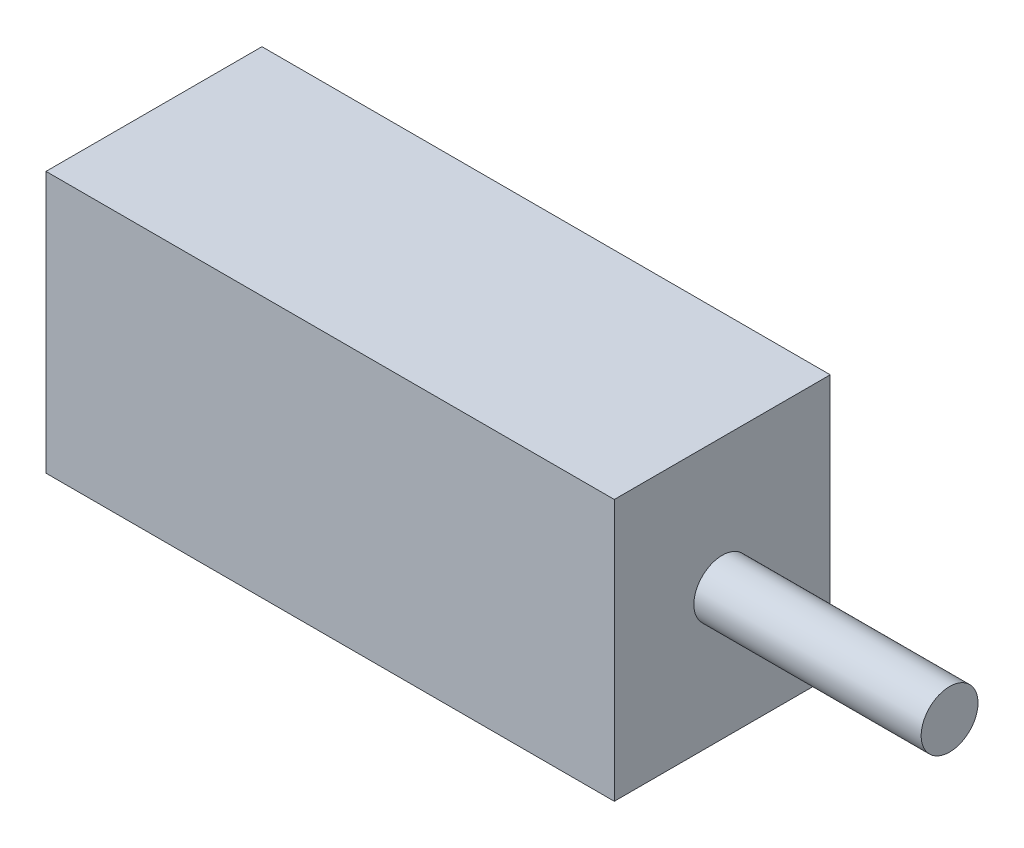
ISO-10303-21;
HEADER;
FILE_DESCRIPTION(('STEP AP214'),'2;1');
FILE_NAME('part.step','',(''),(''),'','','');
FILE_SCHEMA(('AUTOMOTIVE_DESIGN { 1 0 10303 214 1 1 1 1 }'));
ENDSEC;
DATA;
#1=APPLICATION_CONTEXT('core data for automotive mechanical design processes');
#2=APPLICATION_PROTOCOL_DEFINITION('international standard','automotive_design',2000,#1);
#3=PRODUCT_CONTEXT('',#1,'mechanical');
#4=PRODUCT('Part','Part','',(#3));
#5=PRODUCT_RELATED_PRODUCT_CATEGORY('part','',(#4));
#6=PRODUCT_DEFINITION_FORMATION('','',#4);
#7=PRODUCT_DEFINITION_CONTEXT('part definition',#1,'design');
#8=PRODUCT_DEFINITION('design','',#6,#7);
#9=PRODUCT_DEFINITION_SHAPE('','',#8);
#10=(LENGTH_UNIT() NAMED_UNIT(*) SI_UNIT(.MILLI.,.METRE.));
#11=(NAMED_UNIT(*) PLANE_ANGLE_UNIT() SI_UNIT($,.RADIAN.));
#12=(NAMED_UNIT(*) SI_UNIT($,.STERADIAN.) SOLID_ANGLE_UNIT());
#13=UNCERTAINTY_MEASURE_WITH_UNIT(LENGTH_MEASURE(1.E-05),#10,'distance_accuracy_value','');
#14=(GEOMETRIC_REPRESENTATION_CONTEXT(3) GLOBAL_UNCERTAINTY_ASSIGNED_CONTEXT((#13)) GLOBAL_UNIT_ASSIGNED_CONTEXT((#10,
#11,#12)) REPRESENTATION_CONTEXT('',''));
#15=CARTESIAN_POINT('',(0.,0.,0.));
#16=DIRECTION('',(0.,0.,1.));
#17=DIRECTION('',(1.,0.,0.));
#18=AXIS2_PLACEMENT_3D('',#15,#16,#17);
#19=CARTESIAN_POINT('',(10.,0.,0.));
#20=DIRECTION('',(-1.,0.,0.));
#21=DIRECTION('',(0.,0.,1.));
#22=AXIS2_PLACEMENT_3D('',#19,#20,#21);
#23=CYLINDRICAL_SURFACE('',#22,1.25);
#24=CARTESIAN_POINT('',(10.,0.,0.));
#25=DIRECTION('',(1.,0.,0.));
#26=DIRECTION('',(0.,0.,-1.));
#27=AXIS2_PLACEMENT_3D('',#24,#25,#26);
#28=CIRCLE('',#27,1.25);
#29=CARTESIAN_POINT('',(10.,0.,-1.25));
#30=VERTEX_POINT('',#29);
#31=EDGE_CURVE('E11',#30,#30,#28,.T.);
#32=ORIENTED_EDGE('',*,*,#31,.F.);
#33=EDGE_LOOP('',(#32));
#34=FACE_BOUND('',#33,.T.);
#35=CARTESIAN_POINT('',(0.,0.,0.));
#36=DIRECTION('',(1.,0.,0.));
#37=DIRECTION('',(0.,0.,-1.));
#38=AXIS2_PLACEMENT_3D('',#35,#36,#37);
#39=CIRCLE('',#38,1.25);
#40=CARTESIAN_POINT('',(0.,0.,-1.25));
#41=VERTEX_POINT('',#40);
#42=EDGE_CURVE('E42',#41,#41,#39,.T.);
#43=ORIENTED_EDGE('',*,*,#42,.T.);
#44=EDGE_LOOP('',(#43));
#45=FACE_BOUND('',#44,.T.);
#46=ADVANCED_FACE('F39',(#34,#45),#23,.T.);
#47=CARTESIAN_POINT('',(10.,0.,0.));
#48=DIRECTION('',(1.,0.,0.));
#49=DIRECTION('',(0.,0.,-1.));
#50=AXIS2_PLACEMENT_3D('',#47,#48,#49);
#51=PLANE('',#50);
#52=ORIENTED_EDGE('',*,*,#31,.T.);
#53=EDGE_LOOP('',(#52));
#54=FACE_BOUND('',#53,.T.);
#55=ADVANCED_FACE('F148',(#54),#51,.T.);
#56=CARTESIAN_POINT('',(-25.,5.75,4.75));
#57=DIRECTION('',(0.,0.,-1.));
#58=DIRECTION('',(0.,1.,0.));
#59=AXIS2_PLACEMENT_3D('',#56,#57,#58);
#60=PLANE('',#59);
#61=DIRECTION('',(0.,1.,0.));
#62=VECTOR('',#61,1.);
#63=CARTESIAN_POINT('',(0.,5.75,4.75));
#64=LINE('',#63,#62);
#65=CARTESIAN_POINT('',(0.,-5.75,4.75));
#66=VERTEX_POINT('',#65);
#67=CARTESIAN_POINT('',(0.,5.75,4.75));
#68=VERTEX_POINT('',#67);
#69=EDGE_CURVE('E111',#66,#68,#64,.T.);
#70=ORIENTED_EDGE('',*,*,#69,.T.);
#71=DIRECTION('',(1.,0.,0.));
#72=VECTOR('',#71,1.);
#73=CARTESIAN_POINT('',(-25.,5.75,4.75));
#74=LINE('',#73,#72);
#75=CARTESIAN_POINT('',(-25.,5.75,4.75));
#76=VERTEX_POINT('',#75);
#77=EDGE_CURVE('E100',#76,#68,#74,.T.);
#78=ORIENTED_EDGE('',*,*,#77,.F.);
#79=DIRECTION('',(0.,1.,0.));
#80=VECTOR('',#79,1.);
#81=CARTESIAN_POINT('',(-25.,5.75,4.75));
#82=LINE('',#81,#80);
#83=CARTESIAN_POINT('',(-25.,-5.75,4.75));
#84=VERTEX_POINT('',#83);
#85=EDGE_CURVE('E92',#84,#76,#82,.T.);
#86=ORIENTED_EDGE('',*,*,#85,.F.);
#87=DIRECTION('',(1.,0.,0.));
#88=VECTOR('',#87,1.);
#89=CARTESIAN_POINT('',(-25.,-5.75,4.75));
#90=LINE('',#89,#88);
#91=EDGE_CURVE('E107',#84,#66,#90,.T.);
#92=ORIENTED_EDGE('',*,*,#91,.T.);
#93=EDGE_LOOP('',(#70,#78,#86,#92));
#94=FACE_BOUND('',#93,.T.);
#95=ADVANCED_FACE('F137',(#94),#60,.F.);
#96=CARTESIAN_POINT('',(-25.,5.75,-4.75));
#97=DIRECTION('',(0.,-1.,0.));
#98=DIRECTION('',(0.,0.,-1.));
#99=AXIS2_PLACEMENT_3D('',#96,#97,#98);
#100=PLANE('',#99);
#101=DIRECTION('',(0.,0.,-1.));
#102=VECTOR('',#101,1.);
#103=CARTESIAN_POINT('',(0.,5.75,-4.75));
#104=LINE('',#103,#102);
#105=CARTESIAN_POINT('',(0.,5.75,-4.75));
#106=VERTEX_POINT('',#105);
#107=EDGE_CURVE('E98',#68,#106,#104,.T.);
#108=ORIENTED_EDGE('',*,*,#107,.T.);
#109=DIRECTION('',(1.,0.,0.));
#110=VECTOR('',#109,1.);
#111=CARTESIAN_POINT('',(-25.,5.75,-4.75));
#112=LINE('',#111,#110);
#113=CARTESIAN_POINT('',(-25.,5.75,-4.75));
#114=VERTEX_POINT('',#113);
#115=EDGE_CURVE('E96',#114,#106,#112,.T.);
#116=ORIENTED_EDGE('',*,*,#115,.F.);
#117=DIRECTION('',(0.,0.,-1.));
#118=VECTOR('',#117,1.);
#119=CARTESIAN_POINT('',(-25.,5.75,-4.75));
#120=LINE('',#119,#118);
#121=EDGE_CURVE('E87',#76,#114,#120,.T.);
#122=ORIENTED_EDGE('',*,*,#121,.F.);
#123=ORIENTED_EDGE('',*,*,#77,.T.);
#124=EDGE_LOOP('',(#108,#116,#122,#123));
#125=FACE_BOUND('',#124,.T.);
#126=ADVANCED_FACE('F97',(#125),#100,.F.);
#127=CARTESIAN_POINT('',(-25.,5.75,-4.75));
#128=DIRECTION('',(0.,0.,1.));
#129=DIRECTION('',(0.,-1.,0.));
#130=AXIS2_PLACEMENT_3D('',#127,#128,#129);
#131=PLANE('',#130);
#132=DIRECTION('',(0.,-1.,0.));
#133=VECTOR('',#132,1.);
#134=CARTESIAN_POINT('',(0.,5.75,-4.75));
#135=LINE('',#134,#133);
#136=CARTESIAN_POINT('',(0.,-5.75,-4.75));
#137=VERTEX_POINT('',#136);
#138=EDGE_CURVE('E73',#106,#137,#135,.T.);
#139=ORIENTED_EDGE('',*,*,#138,.T.);
#140=DIRECTION('',(1.,0.,0.));
#141=VECTOR('',#140,1.);
#142=CARTESIAN_POINT('',(-25.,-5.75,-4.75));
#143=LINE('',#142,#141);
#144=CARTESIAN_POINT('',(-25.,-5.75,-4.75));
#145=VERTEX_POINT('',#144);
#146=EDGE_CURVE('E101',#145,#137,#143,.T.);
#147=ORIENTED_EDGE('',*,*,#146,.F.);
#148=DIRECTION('',(0.,-1.,0.));
#149=VECTOR('',#148,1.);
#150=CARTESIAN_POINT('',(-25.,5.75,-4.75));
#151=LINE('',#150,#149);
#152=EDGE_CURVE('E90',#114,#145,#151,.T.);
#153=ORIENTED_EDGE('',*,*,#152,.F.);
#154=ORIENTED_EDGE('',*,*,#115,.T.);
#155=EDGE_LOOP('',(#139,#147,#153,#154));
#156=FACE_BOUND('',#155,.T.);
#157=ADVANCED_FACE('F103',(#156),#131,.F.);
#158=CARTESIAN_POINT('',(-25.,-5.75,-4.75));
#159=DIRECTION('',(0.,1.,0.));
#160=DIRECTION('',(0.,0.,1.));
#161=AXIS2_PLACEMENT_3D('',#158,#159,#160);
#162=PLANE('',#161);
#163=DIRECTION('',(0.,0.,1.));
#164=VECTOR('',#163,1.);
#165=CARTESIAN_POINT('',(0.,-5.75,-4.75));
#166=LINE('',#165,#164);
#167=EDGE_CURVE('E79',#137,#66,#166,.T.);
#168=ORIENTED_EDGE('',*,*,#167,.T.);
#169=ORIENTED_EDGE('',*,*,#91,.F.);
#170=DIRECTION('',(0.,0.,1.));
#171=VECTOR('',#170,1.);
#172=CARTESIAN_POINT('',(-25.,-5.75,-4.75));
#173=LINE('',#172,#171);
#174=EDGE_CURVE('E56',#145,#84,#173,.T.);
#175=ORIENTED_EDGE('',*,*,#174,.F.);
#176=ORIENTED_EDGE('',*,*,#146,.T.);
#177=EDGE_LOOP('',(#168,#169,#175,#176));
#178=FACE_BOUND('',#177,.T.);
#179=ADVANCED_FACE('F138',(#178),#162,.F.);
#180=CARTESIAN_POINT('',(-25.,0.,0.));
#181=DIRECTION('',(-1.,0.,0.));
#182=DIRECTION('',(0.,0.,1.));
#183=AXIS2_PLACEMENT_3D('',#180,#181,#182);
#184=PLANE('',#183);
#185=ORIENTED_EDGE('',*,*,#85,.T.);
#186=ORIENTED_EDGE('',*,*,#121,.T.);
#187=ORIENTED_EDGE('',*,*,#152,.T.);
#188=ORIENTED_EDGE('',*,*,#174,.T.);
#189=EDGE_LOOP('',(#185,#186,#187,#188));
#190=FACE_BOUND('',#189,.T.);
#191=ADVANCED_FACE('F88',(#190),#184,.T.);
#192=CARTESIAN_POINT('',(0.,0.,0.));
#193=DIRECTION('',(-1.,0.,0.));
#194=DIRECTION('',(0.,0.,1.));
#195=AXIS2_PLACEMENT_3D('',#192,#193,#194);
#196=PLANE('',#195);
#197=ORIENTED_EDGE('',*,*,#42,.F.);
#198=EDGE_LOOP('',(#197));
#199=FACE_BOUND('',#198,.T.);
#200=ORIENTED_EDGE('',*,*,#69,.F.);
#201=ORIENTED_EDGE('',*,*,#167,.F.);
#202=ORIENTED_EDGE('',*,*,#138,.F.);
#203=ORIENTED_EDGE('',*,*,#107,.F.);
#204=EDGE_LOOP('',(#200,#201,#202,#203));
#205=FACE_BOUND('',#204,.T.);
#206=ADVANCED_FACE('F131',(#199,#205),#196,.F.);
#207=CLOSED_SHELL('',(#46,#55,#95,#126,#157,#179,#191,#206));
#208=MANIFOLD_SOLID_BREP('B2',#207);
#209=ADVANCED_BREP_SHAPE_REPRESENTATION('',(#18,#208),#14);
#210=SHAPE_DEFINITION_REPRESENTATION(#9,#209);
ENDSEC;
END-ISO-10303-21;
